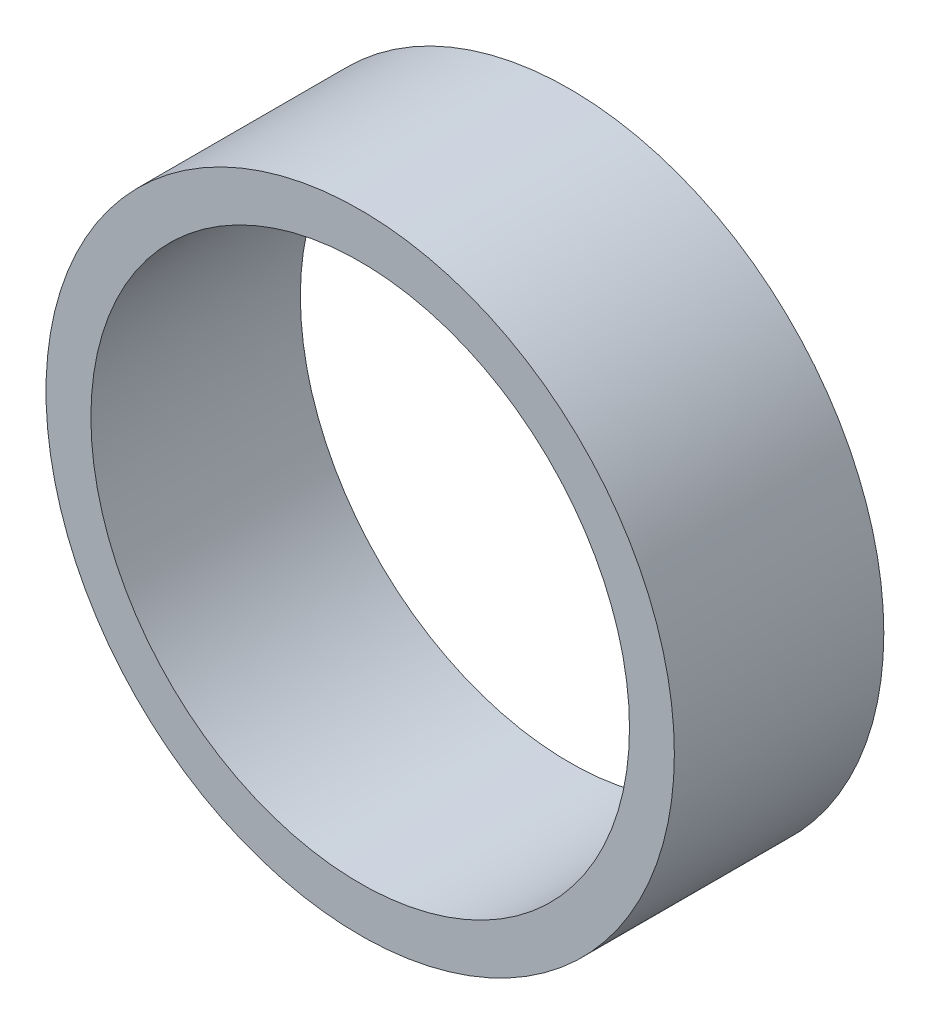
ISO-10303-21;
HEADER;
FILE_DESCRIPTION(('STEP AP214'),'2;1');
FILE_NAME('part.step','',(''),(''),'','','');
FILE_SCHEMA(('AUTOMOTIVE_DESIGN { 1 0 10303 214 1 1 1 1 }'));
ENDSEC;
DATA;
#1=APPLICATION_CONTEXT('core data for automotive mechanical design processes');
#2=APPLICATION_PROTOCOL_DEFINITION('international standard','automotive_design',2000,#1);
#3=PRODUCT_CONTEXT('',#1,'mechanical');
#4=PRODUCT('Part','Part','',(#3));
#5=PRODUCT_RELATED_PRODUCT_CATEGORY('part','',(#4));
#6=PRODUCT_DEFINITION_FORMATION('','',#4);
#7=PRODUCT_DEFINITION_CONTEXT('part definition',#1,'design');
#8=PRODUCT_DEFINITION('design','',#6,#7);
#9=PRODUCT_DEFINITION_SHAPE('','',#8);
#10=(LENGTH_UNIT() NAMED_UNIT(*) SI_UNIT(.MILLI.,.METRE.));
#11=(NAMED_UNIT(*) PLANE_ANGLE_UNIT() SI_UNIT($,.RADIAN.));
#12=(NAMED_UNIT(*) SI_UNIT($,.STERADIAN.) SOLID_ANGLE_UNIT());
#13=UNCERTAINTY_MEASURE_WITH_UNIT(LENGTH_MEASURE(1.E-05),#10,'distance_accuracy_value','');
#14=(GEOMETRIC_REPRESENTATION_CONTEXT(3) GLOBAL_UNCERTAINTY_ASSIGNED_CONTEXT((#13)) GLOBAL_UNIT_ASSIGNED_CONTEXT((#10,
#11,#12)) REPRESENTATION_CONTEXT('',''));
#15=CARTESIAN_POINT('',(0.,0.,0.));
#16=DIRECTION('',(0.,0.,1.));
#17=DIRECTION('',(1.,0.,0.));
#18=AXIS2_PLACEMENT_3D('',#15,#16,#17);
#19=CARTESIAN_POINT('',(0.,0.,177.8));
#20=DIRECTION('',(0.,0.,1.));
#21=DIRECTION('',(1.,0.,0.));
#22=AXIS2_PLACEMENT_3D('',#19,#20,#21);
#23=PLANE('',#22);
#24=CARTESIAN_POINT('',(0.,0.,177.8));
#25=DIRECTION('',(0.,0.,1.));
#26=DIRECTION('',(1.,0.,0.));
#27=AXIS2_PLACEMENT_3D('',#24,#25,#26);
#28=CIRCLE('',#27,266.7);
#29=CARTESIAN_POINT('',(266.7,0.,177.8));
#30=VERTEX_POINT('',#29);
#31=EDGE_CURVE('E10',#30,#30,#28,.T.);
#32=ORIENTED_EDGE('',*,*,#31,.T.);
#33=EDGE_LOOP('',(#32));
#34=FACE_BOUND('',#33,.T.);
#35=CARTESIAN_POINT('',(0.,0.,177.8));
#36=DIRECTION('',(0.,0.,1.));
#37=DIRECTION('',(1.,0.,0.));
#38=AXIS2_PLACEMENT_3D('',#35,#36,#37);
#39=CIRCLE('',#38,228.6);
#40=CARTESIAN_POINT('',(228.6,0.,177.8));
#41=VERTEX_POINT('',#40);
#42=EDGE_CURVE('E51',#41,#41,#39,.T.);
#43=ORIENTED_EDGE('',*,*,#42,.F.);
#44=EDGE_LOOP('',(#43));
#45=FACE_BOUND('',#44,.T.);
#46=ADVANCED_FACE('F37',(#34,#45),#23,.T.);
#47=CARTESIAN_POINT('',(0.,0.,0.));
#48=DIRECTION('',(0.,0.,1.));
#49=DIRECTION('',(1.,0.,0.));
#50=AXIS2_PLACEMENT_3D('',#47,#48,#49);
#51=PLANE('',#50);
#52=CARTESIAN_POINT('',(0.,0.,0.));
#53=DIRECTION('',(0.,0.,1.));
#54=DIRECTION('',(1.,0.,0.));
#55=AXIS2_PLACEMENT_3D('',#52,#53,#54);
#56=CIRCLE('',#55,266.7);
#57=CARTESIAN_POINT('',(266.7,0.,0.));
#58=VERTEX_POINT('',#57);
#59=EDGE_CURVE('E41',#58,#58,#56,.T.);
#60=ORIENTED_EDGE('',*,*,#59,.F.);
#61=EDGE_LOOP('',(#60));
#62=FACE_BOUND('',#61,.T.);
#63=CARTESIAN_POINT('',(0.,0.,0.));
#64=DIRECTION('',(0.,0.,1.));
#65=DIRECTION('',(1.,0.,0.));
#66=AXIS2_PLACEMENT_3D('',#63,#64,#65);
#67=CIRCLE('',#66,228.6);
#68=CARTESIAN_POINT('',(228.6,0.,0.));
#69=VERTEX_POINT('',#68);
#70=EDGE_CURVE('E53',#69,#69,#67,.T.);
#71=ORIENTED_EDGE('',*,*,#70,.T.);
#72=EDGE_LOOP('',(#71));
#73=FACE_BOUND('',#72,.T.);
#74=ADVANCED_FACE('F64',(#62,#73),#51,.F.);
#75=CARTESIAN_POINT('',(0.,0.,177.8));
#76=DIRECTION('',(0.,0.,-1.));
#77=DIRECTION('',(-1.,0.,0.));
#78=AXIS2_PLACEMENT_3D('',#75,#76,#77);
#79=CYLINDRICAL_SURFACE('',#78,266.7);
#80=ORIENTED_EDGE('',*,*,#31,.F.);
#81=EDGE_LOOP('',(#80));
#82=FACE_BOUND('',#81,.T.);
#83=ORIENTED_EDGE('',*,*,#59,.T.);
#84=EDGE_LOOP('',(#83));
#85=FACE_BOUND('',#84,.T.);
#86=ADVANCED_FACE('F39',(#82,#85),#79,.T.);
#87=CARTESIAN_POINT('',(0.,0.,177.8));
#88=DIRECTION('',(0.,0.,-1.));
#89=DIRECTION('',(-1.,0.,0.));
#90=AXIS2_PLACEMENT_3D('',#87,#88,#89);
#91=CYLINDRICAL_SURFACE('',#90,228.6);
#92=ORIENTED_EDGE('',*,*,#42,.T.);
#93=EDGE_LOOP('',(#92));
#94=FACE_BOUND('',#93,.T.);
#95=ORIENTED_EDGE('',*,*,#70,.F.);
#96=EDGE_LOOP('',(#95));
#97=FACE_BOUND('',#96,.T.);
#98=ADVANCED_FACE('F60',(#94,#97),#91,.F.);
#99=CLOSED_SHELL('',(#46,#74,#86,#98));
#100=MANIFOLD_SOLID_BREP('B2',#99);
#101=ADVANCED_BREP_SHAPE_REPRESENTATION('',(#18,#100),#14);
#102=SHAPE_DEFINITION_REPRESENTATION(#9,#101);
ENDSEC;
END-ISO-10303-21;
